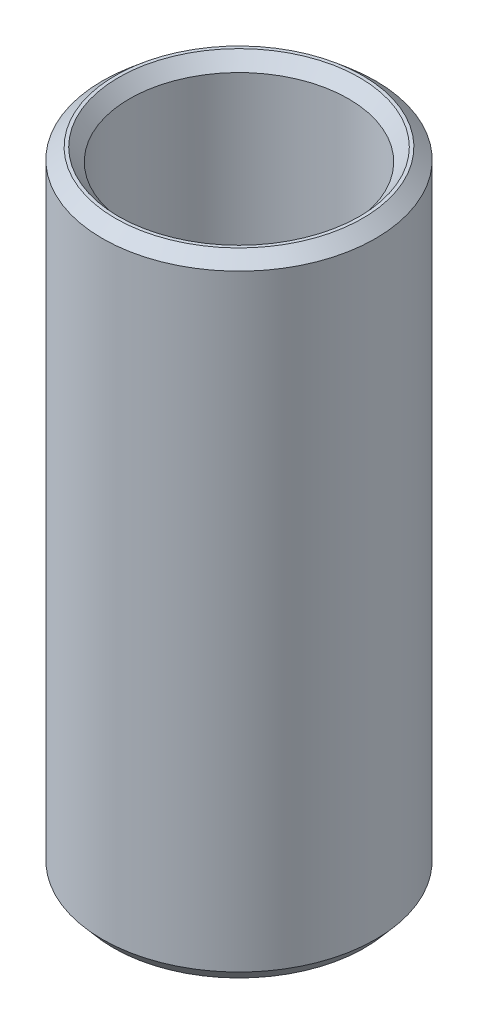
ISO-10303-21;
HEADER;
FILE_DESCRIPTION(('STEP AP214'),'2;1');
FILE_NAME('part.step','',(''),(''),'','','');
FILE_SCHEMA(('AUTOMOTIVE_DESIGN { 1 0 10303 214 1 1 1 1 }'));
ENDSEC;
DATA;
#1=APPLICATION_CONTEXT('core data for automotive mechanical design processes');
#2=APPLICATION_PROTOCOL_DEFINITION('international standard','automotive_design',2000,#1);
#3=PRODUCT_CONTEXT('',#1,'mechanical');
#4=PRODUCT('Part','Part','',(#3));
#5=PRODUCT_RELATED_PRODUCT_CATEGORY('part','',(#4));
#6=PRODUCT_DEFINITION_FORMATION('','',#4);
#7=PRODUCT_DEFINITION_CONTEXT('part definition',#1,'design');
#8=PRODUCT_DEFINITION('design','',#6,#7);
#9=PRODUCT_DEFINITION_SHAPE('','',#8);
#10=(LENGTH_UNIT() NAMED_UNIT(*) SI_UNIT(.MILLI.,.METRE.));
#11=(NAMED_UNIT(*) PLANE_ANGLE_UNIT() SI_UNIT($,.RADIAN.));
#12=(NAMED_UNIT(*) SI_UNIT($,.STERADIAN.) SOLID_ANGLE_UNIT());
#13=UNCERTAINTY_MEASURE_WITH_UNIT(LENGTH_MEASURE(1.E-05),#10,'distance_accuracy_value','');
#14=(GEOMETRIC_REPRESENTATION_CONTEXT(3) GLOBAL_UNCERTAINTY_ASSIGNED_CONTEXT((#13)) GLOBAL_UNIT_ASSIGNED_CONTEXT((#10,
#11,#12)) REPRESENTATION_CONTEXT('',''));
#15=CARTESIAN_POINT('',(0.,0.,0.));
#16=DIRECTION('',(0.,0.,1.));
#17=DIRECTION('',(1.,0.,0.));
#18=AXIS2_PLACEMENT_3D('',#15,#16,#17);
#19=CARTESIAN_POINT('',(0.,138.562156970826,0.));
#20=DIRECTION('',(0.,-1.,0.));
#21=DIRECTION('',(0.,0.,-1.));
#22=AXIS2_PLACEMENT_3D('',#19,#20,#21);
#23=CYLINDRICAL_SURFACE('',#22,30.);
#24=CARTESIAN_POINT('',(0.,2.83569463080405,0.));
#25=DIRECTION('',(0.,1.,0.));
#26=DIRECTION('',(0.,0.,1.));
#27=AXIS2_PLACEMENT_3D('',#24,#25,#26);
#28=CIRCLE('',#27,30.);
#29=CARTESIAN_POINT('',(0.,2.83569463080402,-30.));
#30=VERTEX_POINT('',#29);
#31=EDGE_CURVE('E10',#30,#30,#28,.T.);
#32=CARTESIAN_POINT('',(0.,136.143608110642,0.));
#33=DIRECTION('',(0.,1.,0.));
#34=DIRECTION('',(0.,0.,1.));
#35=AXIS2_PLACEMENT_3D('',#32,#33,#34);
#36=CIRCLE('',#35,30.);
#37=CARTESIAN_POINT('',(0.,136.143608110642,-30.));
#38=VERTEX_POINT('',#37);
#39=EDGE_CURVE('E50',#38,#38,#36,.F.);
#40=CARTESIAN_POINT('',(0.,2.83569463080402,-30.));
#41=CARTESIAN_POINT('',(0.,4.22431872955233,-30.));
#42=CARTESIAN_POINT('',(0.,5.61294282830064,-30.));
#43=CARTESIAN_POINT('',(0.,8.39019102579726,-30.));
#44=CARTESIAN_POINT('',(0.,9.77881512454557,-30.));
#45=CARTESIAN_POINT('',(0.,12.5560633220422,-30.));
#46=CARTESIAN_POINT('',(0.,13.9446874207905,-30.));
#47=CARTESIAN_POINT('',(0.,16.7219356182871,-30.));
#48=CARTESIAN_POINT('',(0.,18.1105597170354,-30.));
#49=CARTESIAN_POINT('',(0.,20.887807914532,-30.));
#50=CARTESIAN_POINT('',(0.,22.2764320132803,-30.));
#51=CARTESIAN_POINT('',(0.,25.053680210777,-30.));
#52=CARTESIAN_POINT('',(0.,26.4423043095253,-30.));
#53=CARTESIAN_POINT('',(0.,29.2195525070219,-30.));
#54=CARTESIAN_POINT('',(0.,30.6081766057702,-30.));
#55=CARTESIAN_POINT('',(0.,33.3854248032668,-30.));
#56=CARTESIAN_POINT('',(0.,34.7740489020151,-30.));
#57=CARTESIAN_POINT('',(0.,37.5512970995117,-30.));
#58=CARTESIAN_POINT('',(0.,38.9399211982601,-30.));
#59=CARTESIAN_POINT('',(0.,41.7171693957567,-30.));
#60=CARTESIAN_POINT('',(0.,43.105793494505,-30.));
#61=CARTESIAN_POINT('',(0.,45.8830416920016,-30.));
#62=CARTESIAN_POINT('',(0.,47.2716657907499,-30.));
#63=CARTESIAN_POINT('',(0.,50.0489139882465,-30.));
#64=CARTESIAN_POINT('',(0.,51.4375380869948,-30.));
#65=CARTESIAN_POINT('',(0.,54.2147862844915,-30.));
#66=CARTESIAN_POINT('',(0.,55.6034103832398,-30.));
#67=CARTESIAN_POINT('',(0.,58.3806585807364,-30.));
#68=CARTESIAN_POINT('',(0.,59.7692826794847,-30.));
#69=CARTESIAN_POINT('',(0.,62.5465308769813,-30.));
#70=CARTESIAN_POINT('',(0.,63.9351549757296,-30.));
#71=CARTESIAN_POINT('',(0.,66.7124031732262,-30.));
#72=CARTESIAN_POINT('',(0.,68.1010272719746,-30.));
#73=CARTESIAN_POINT('',(0.,70.8782754694712,-30.));
#74=CARTESIAN_POINT('',(0.,72.2668995682195,-30.));
#75=CARTESIAN_POINT('',(0.,75.0441477657161,-30.));
#76=CARTESIAN_POINT('',(0.,76.4327718644644,-30.));
#77=CARTESIAN_POINT('',(0.,79.210020061961,-30.));
#78=CARTESIAN_POINT('',(0.,80.5986441607093,-30.));
#79=CARTESIAN_POINT('',(0.,83.375892358206,-30.));
#80=CARTESIAN_POINT('',(0.,84.7645164569543,-30.));
#81=CARTESIAN_POINT('',(0.,87.5417646544509,-30.));
#82=CARTESIAN_POINT('',(0.,88.9303887531992,-30.));
#83=CARTESIAN_POINT('',(0.,91.7076369506958,-30.));
#84=CARTESIAN_POINT('',(0.,93.0962610494441,-30.));
#85=CARTESIAN_POINT('',(0.,95.8735092469407,-30.));
#86=CARTESIAN_POINT('',(0.,97.2621333456891,-30.));
#87=CARTESIAN_POINT('',(0.,100.039381543186,-30.));
#88=CARTESIAN_POINT('',(0.,101.428005641934,-30.));
#89=CARTESIAN_POINT('',(0.,104.205253839431,-30.));
#90=CARTESIAN_POINT('',(0.,105.593877938179,-30.));
#91=CARTESIAN_POINT('',(0.,108.371126135676,-30.));
#92=CARTESIAN_POINT('',(0.,109.759750234424,-30.));
#93=CARTESIAN_POINT('',(0.,112.53699843192,-30.));
#94=CARTESIAN_POINT('',(0.,113.925622530669,-30.));
#95=CARTESIAN_POINT('',(0.,116.702870728165,-30.));
#96=CARTESIAN_POINT('',(0.,118.091494826914,-30.));
#97=CARTESIAN_POINT('',(0.,120.86874302441,-30.));
#98=CARTESIAN_POINT('',(0.,122.257367123159,-30.));
#99=CARTESIAN_POINT('',(0.,125.034615320655,-30.));
#100=CARTESIAN_POINT('',(0.,126.423239419404,-30.));
#101=CARTESIAN_POINT('',(0.,129.2004876169,-30.));
#102=CARTESIAN_POINT('',(0.,130.589111715648,-30.));
#103=CARTESIAN_POINT('',(0.,133.366359913145,-30.));
#104=CARTESIAN_POINT('',(0.,134.754984011893,-30.));
#105=CARTESIAN_POINT('',(0.,136.143608110642,-30.));
#106=B_SPLINE_CURVE_WITH_KNOTS('',3,(#40,#41,#42,#43,#44,#45,#46,#47,#48,#49,#50,#51,#52,#53,
#54,#55,#56,#57,#58,#59,#60,#61,#62,#63,#64,#65,#66,#67,#68,#69,#70,#71,#72,#73,#74,#75,#76,#77,
#78,#79,#80,#81,#82,#83,#84,#85,#86,#87,#88,#89,#90,#91,#92,#93,#94,#95,#96,#97,#98,#99,#100,
#101,#102,#103,#104,#105),.UNSPECIFIED.,.F.,.F.,(4,2,2,2,2,2,2,2,2,2,2,2,2,2,2,2,2,2,2,2,2,2,2,
2,2,2,2,2,2,2,2,2,4),(0.,4.16587229624493,8.33174459248987,12.4976168887348,16.6634891849797,
20.8293614812246,24.9952337774696,29.1611060737145,33.3269783699594,37.4928506662043,
41.6587229624493,45.8245952586942,49.9904675549391,54.1563398511841,58.322212147429,
62.4880844436739,66.6539567399189,70.8198290361638,74.9857013324087,79.1515736286536,
83.3174459248986,87.4833182211435,91.6491905173884,95.8150628136333,99.9809351098783,
104.146807406123,108.312679702368,112.478551998613,116.644424294858,120.810296591103,
124.976168887348,129.142041183593,133.307913479838),.UNSPECIFIED.);
#107=EDGE_CURVE('BSEAM39',#30,#38,#106,.T.);
#108=ORIENTED_EDGE('',*,*,#31,.T.);
#109=ORIENTED_EDGE('',*,*,#39,.T.);
#110=ORIENTED_EDGE('',*,*,#107,.T.);
#111=ORIENTED_EDGE('',*,*,#107,.F.);
#112=EDGE_LOOP('',(#108,#110,#109,#111));
#113=FACE_BOUND('',#112,.T.);
#114=ADVANCED_FACE('F39',(#113),#23,.T.);
#115=CARTESIAN_POINT('',(0.,138.562156970826,0.));
#116=DIRECTION('',(0.,1.,0.));
#117=DIRECTION('',(0.,0.,1.));
#118=AXIS2_PLACEMENT_3D('',#115,#116,#117);
#119=PLANE('',#118);
#120=CARTESIAN_POINT('',(0.,138.562156970826,0.));
#121=DIRECTION('',(0.,1.,0.));
#122=DIRECTION('',(0.,0.,1.));
#123=AXIS2_PLACEMENT_3D('',#120,#121,#122);
#124=CIRCLE('',#123,26.4517690557985);
#125=CARTESIAN_POINT('',(0.,138.562156970826,26.4517690557985));
#126=VERTEX_POINT('',#125);
#127=EDGE_CURVE('E58',#126,#126,#124,.F.);
#128=ORIENTED_EDGE('',*,*,#127,.T.);
#129=EDGE_LOOP('',(#128));
#130=FACE_BOUND('',#129,.T.);
#131=CARTESIAN_POINT('',(0.,138.562156970826,0.));
#132=DIRECTION('',(0.,1.,0.));
#133=DIRECTION('',(0.,0.,1.));
#134=AXIS2_PLACEMENT_3D('',#131,#132,#133);
#135=CIRCLE('',#134,27.1643053691961);
#136=CARTESIAN_POINT('',(0.,138.562156970826,27.1643053691961));
#137=VERTEX_POINT('',#136);
#138=EDGE_CURVE('E61',#137,#137,#135,.T.);
#139=ORIENTED_EDGE('',*,*,#138,.T.);
#140=EDGE_LOOP('',(#139));
#141=FACE_BOUND('',#140,.T.);
#142=ADVANCED_FACE('F88',(#130,#141),#119,.T.);
#143=CARTESIAN_POINT('',(0.,0.,0.));
#144=DIRECTION('',(0.,1.,0.));
#145=DIRECTION('',(0.,0.,1.));
#146=AXIS2_PLACEMENT_3D('',#143,#144,#145);
#147=PLANE('',#146);
#148=CARTESIAN_POINT('',(0.,0.,0.));
#149=DIRECTION('',(0.,1.,0.));
#150=DIRECTION('',(0.,0.,1.));
#151=AXIS2_PLACEMENT_3D('',#148,#149,#150);
#152=CIRCLE('',#151,26.8689148264178);
#153=CARTESIAN_POINT('',(0.,0.,26.8689148264178));
#154=VERTEX_POINT('',#153);
#155=EDGE_CURVE('E51',#154,#154,#152,.T.);
#156=ORIENTED_EDGE('',*,*,#155,.T.);
#157=EDGE_LOOP('',(#156));
#158=FACE_BOUND('',#157,.T.);
#159=CARTESIAN_POINT('',(0.,0.,0.));
#160=DIRECTION('',(0.,1.,0.));
#161=DIRECTION('',(0.,0.,1.));
#162=AXIS2_PLACEMENT_3D('',#159,#160,#161);
#163=CIRCLE('',#162,27.5814511398154);
#164=CARTESIAN_POINT('',(0.,0.,27.5814511398154));
#165=VERTEX_POINT('',#164);
#166=EDGE_CURVE('E54',#165,#165,#163,.F.);
#167=ORIENTED_EDGE('',*,*,#166,.T.);
#168=EDGE_LOOP('',(#167));
#169=FACE_BOUND('',#168,.T.);
#170=ADVANCED_FACE('F83',(#158,#169),#147,.F.);
#171=CARTESIAN_POINT('',(0.,138.562156970826,0.));
#172=DIRECTION('',(0.,-1.,0.));
#173=DIRECTION('',(0.,0.,-1.));
#174=AXIS2_PLACEMENT_3D('',#171,#172,#173);
#175=CYLINDRICAL_SURFACE('',#174,24.0332201956139);
#176=CARTESIAN_POINT('',(0.,135.726462340022,0.));
#177=DIRECTION('',(0.,1.,0.));
#178=DIRECTION('',(0.,0.,1.));
#179=AXIS2_PLACEMENT_3D('',#176,#177,#178);
#180=CIRCLE('',#179,24.0332201956139);
#181=CARTESIAN_POINT('',(0.,135.726462340022,-24.0332201956139));
#182=VERTEX_POINT('',#181);
#183=EDGE_CURVE('E67',#182,#182,#180,.T.);
#184=CARTESIAN_POINT('',(0.,2.41854886018453,0.));
#185=DIRECTION('',(0.,1.,0.));
#186=DIRECTION('',(0.,0.,1.));
#187=AXIS2_PLACEMENT_3D('',#184,#185,#186);
#188=CIRCLE('',#187,24.0332201956139);
#189=CARTESIAN_POINT('',(0.,2.4185488601845,-24.0332201956139));
#190=VERTEX_POINT('',#189);
#191=EDGE_CURVE('E69',#190,#190,#188,.F.);
#192=CARTESIAN_POINT('',(0.,135.726462340022,-24.0332201956139));
#193=CARTESIAN_POINT('',(0.,134.337838241274,-24.0332201956139));
#194=CARTESIAN_POINT('',(0.,132.949214142526,-24.0332201956139));
#195=CARTESIAN_POINT('',(0.,130.171965945029,-24.0332201956139));
#196=CARTESIAN_POINT('',(0.,128.783341846281,-24.0332201956139));
#197=CARTESIAN_POINT('',(0.,126.006093648784,-24.0332201956139));
#198=CARTESIAN_POINT('',(0.,124.617469550036,-24.0332201956139));
#199=CARTESIAN_POINT('',(0.,121.840221352539,-24.0332201956139));
#200=CARTESIAN_POINT('',(0.,120.451597253791,-24.0332201956139));
#201=CARTESIAN_POINT('',(0.,117.674349056294,-24.0332201956139));
#202=CARTESIAN_POINT('',(0.,116.285724957546,-24.0332201956139));
#203=CARTESIAN_POINT('',(0.,113.508476760049,-24.0332201956139));
#204=CARTESIAN_POINT('',(0.,112.119852661301,-24.0332201956139));
#205=CARTESIAN_POINT('',(0.,109.342604463804,-24.0332201956139));
#206=CARTESIAN_POINT('',(0.,107.953980365056,-24.0332201956139));
#207=CARTESIAN_POINT('',(0.,105.176732167559,-24.0332201956139));
#208=CARTESIAN_POINT('',(0.,103.788108068811,-24.0332201956139));
#209=CARTESIAN_POINT('',(0.,101.010859871314,-24.0332201956139));
#210=CARTESIAN_POINT('',(0.,99.6222357725661,-24.0332201956139));
#211=CARTESIAN_POINT('',(0.,96.8449875750695,-24.0332201956139));
#212=CARTESIAN_POINT('',(0.,95.4563634763212,-24.0332201956139));
#213=CARTESIAN_POINT('',(0.,92.6791152788246,-24.0332201956139));
#214=CARTESIAN_POINT('',(0.,91.2904911800763,-24.0332201956139));
#215=CARTESIAN_POINT('',(0.,88.5132429825797,-24.0332201956139));
#216=CARTESIAN_POINT('',(0.,87.1246188838313,-24.0332201956139));
#217=CARTESIAN_POINT('',(0.,84.3473706863347,-24.0332201956139));
#218=CARTESIAN_POINT('',(0.,82.9587465875864,-24.0332201956139));
#219=CARTESIAN_POINT('',(0.,80.1814983900898,-24.0332201956139));
#220=CARTESIAN_POINT('',(0.,78.7928742913415,-24.0332201956139));
#221=CARTESIAN_POINT('',(0.,76.0156260938449,-24.0332201956139));
#222=CARTESIAN_POINT('',(0.,74.6270019950966,-24.0332201956139));
#223=CARTESIAN_POINT('',(0.,71.8497537976,-24.0332201956139));
#224=CARTESIAN_POINT('',(0.,70.4611296988516,-24.0332201956139));
#225=CARTESIAN_POINT('',(0.,67.683881501355,-24.0332201956139));
#226=CARTESIAN_POINT('',(0.,66.2952574026067,-24.0332201956139));
#227=CARTESIAN_POINT('',(0.,63.5180092051101,-24.0332201956139));
#228=CARTESIAN_POINT('',(0.,62.1293851063618,-24.0332201956139));
#229=CARTESIAN_POINT('',(0.,59.3521369088652,-24.0332201956139));
#230=CARTESIAN_POINT('',(0.,57.9635128101169,-24.0332201956139));
#231=CARTESIAN_POINT('',(0.,55.1862646126202,-24.0332201956139));
#232=CARTESIAN_POINT('',(0.,53.7976405138719,-24.0332201956139));
#233=CARTESIAN_POINT('',(0.,51.0203923163753,-24.0332201956139));
#234=CARTESIAN_POINT('',(0.,49.631768217627,-24.0332201956139));
#235=CARTESIAN_POINT('',(0.,46.8545200201304,-24.0332201956139));
#236=CARTESIAN_POINT('',(0.,45.4658959213821,-24.0332201956139));
#237=CARTESIAN_POINT('',(0.,42.6886477238855,-24.0332201956139));
#238=CARTESIAN_POINT('',(0.,41.3000236251372,-24.0332201956139));
#239=CARTESIAN_POINT('',(0.,38.5227754276405,-24.0332201956139));
#240=CARTESIAN_POINT('',(0.,37.1341513288922,-24.0332201956139));
#241=CARTESIAN_POINT('',(0.,34.3569031313956,-24.0332201956139));
#242=CARTESIAN_POINT('',(0.,32.9682790326473,-24.0332201956139));
#243=CARTESIAN_POINT('',(0.,30.1910308351507,-24.0332201956139));
#244=CARTESIAN_POINT('',(0.,28.8024067364023,-24.0332201956139));
#245=CARTESIAN_POINT('',(0.,26.0251585389057,-24.0332201956139));
#246=CARTESIAN_POINT('',(0.,24.6365344401574,-24.0332201956139));
#247=CARTESIAN_POINT('',(0.,21.8592862426608,-24.0332201956139));
#248=CARTESIAN_POINT('',(0.,20.4706621439125,-24.0332201956139));
#249=CARTESIAN_POINT('',(0.,17.6934139464159,-24.0332201956139));
#250=CARTESIAN_POINT('',(0.,16.3047898476676,-24.0332201956139));
#251=CARTESIAN_POINT('',(0.,13.527541650171,-24.0332201956139));
#252=CARTESIAN_POINT('',(0.,12.1389175514227,-24.0332201956139));
#253=CARTESIAN_POINT('',(0.,9.36166935392605,-24.0332201956139));
#254=CARTESIAN_POINT('',(0.,7.97304525517774,-24.0332201956139));
#255=CARTESIAN_POINT('',(0.,5.19579705768112,-24.0332201956139));
#256=CARTESIAN_POINT('',(0.,3.80717295893281,-24.0332201956139));
#257=CARTESIAN_POINT('',(0.,2.4185488601845,-24.0332201956139));
#258=B_SPLINE_CURVE_WITH_KNOTS('',3,(#192,#193,#194,#195,#196,#197,#198,#199,#200,#201,#202,
#203,#204,#205,#206,#207,#208,#209,#210,#211,#212,#213,#214,#215,#216,#217,#218,#219,#220,#221,
#222,#223,#224,#225,#226,#227,#228,#229,#230,#231,#232,#233,#234,#235,#236,#237,#238,#239,#240,
#241,#242,#243,#244,#245,#246,#247,#248,#249,#250,#251,#252,#253,#254,#255,#256,#257),
.UNSPECIFIED.,.F.,.F.,(4,2,2,2,2,2,2,2,2,2,2,2,2,2,2,2,2,2,2,2,2,2,2,2,2,2,2,2,2,2,2,2,4),(0.,
4.16587229624493,8.33174459248987,12.4976168887348,16.6634891849797,20.8293614812247,
24.9952337774696,29.1611060737145,33.3269783699594,37.4928506662044,41.6587229624493,
45.8245952586942,49.9904675549392,54.1563398511841,58.322212147429,62.4880844436739,
66.6539567399189,70.8198290361638,74.9857013324087,79.1515736286537,83.3174459248986,
87.4833182211435,91.6491905173884,95.8150628136334,99.9809351098783,104.146807406123,
108.312679702368,112.478551998613,116.644424294858,120.810296591103,124.976168887348,
129.142041183593,133.307913479838),.UNSPECIFIED.);
#259=EDGE_CURVE('BSEAM71',#182,#190,#258,.T.);
#260=ORIENTED_EDGE('',*,*,#183,.T.);
#261=ORIENTED_EDGE('',*,*,#191,.T.);
#262=ORIENTED_EDGE('',*,*,#259,.T.);
#263=ORIENTED_EDGE('',*,*,#259,.F.);
#264=EDGE_LOOP('',(#260,#262,#261,#263));
#265=FACE_BOUND('',#264,.T.);
#266=ADVANCED_FACE('F71',(#265),#175,.F.);
#267=CARTESIAN_POINT('',(0.,135.726462340022,0.));
#268=DIRECTION('',(0.,1.,0.));
#269=DIRECTION('',(0.,0.,1.));
#270=AXIS2_PLACEMENT_3D('',#267,#268,#269);
#271=CONICAL_SURFACE('',#270,24.0332201956139,0.706172175551748);
#272=ORIENTED_EDGE('',*,*,#127,.F.);
#273=EDGE_LOOP('',(#272));
#274=FACE_BOUND('',#273,.T.);
#275=ORIENTED_EDGE('',*,*,#183,.F.);
#276=EDGE_LOOP('',(#275));
#277=FACE_BOUND('',#276,.T.);
#278=ADVANCED_FACE('F77',(#274,#277),#271,.F.);
#279=CARTESIAN_POINT('',(0.,0.,0.));
#280=DIRECTION('',(0.,-1.,0.));
#281=DIRECTION('',(0.,0.,-1.));
#282=AXIS2_PLACEMENT_3D('',#279,#280,#281);
#283=CONICAL_SURFACE('',#282,26.8689148264178,0.864624151243138);
#284=ORIENTED_EDGE('',*,*,#191,.F.);
#285=EDGE_LOOP('',(#284));
#286=FACE_BOUND('',#285,.T.);
#287=ORIENTED_EDGE('',*,*,#155,.F.);
#288=EDGE_LOOP('',(#287));
#289=FACE_BOUND('',#288,.T.);
#290=ADVANCED_FACE('F73',(#286,#289),#283,.F.);
#291=CARTESIAN_POINT('',(0.,2.83569463080405,0.));
#292=DIRECTION('',(0.,1.,0.));
#293=DIRECTION('',(0.,0.,1.));
#294=AXIS2_PLACEMENT_3D('',#291,#292,#293);
#295=CONICAL_SURFACE('',#294,30.,0.706172175551757);
#296=ORIENTED_EDGE('',*,*,#166,.F.);
#297=EDGE_LOOP('',(#296));
#298=FACE_BOUND('',#297,.T.);
#299=ORIENTED_EDGE('',*,*,#31,.F.);
#300=EDGE_LOOP('',(#299));
#301=FACE_BOUND('',#300,.T.);
#302=ADVANCED_FACE('F76',(#298,#301),#295,.T.);
#303=CARTESIAN_POINT('',(0.,138.562156970826,0.));
#304=DIRECTION('',(0.,-1.,0.));
#305=DIRECTION('',(0.,0.,-1.));
#306=AXIS2_PLACEMENT_3D('',#303,#304,#305);
#307=CONICAL_SURFACE('',#306,27.1643053691961,0.864624151243142);
#308=ORIENTED_EDGE('',*,*,#39,.F.);
#309=EDGE_LOOP('',(#308));
#310=FACE_BOUND('',#309,.T.);
#311=ORIENTED_EDGE('',*,*,#138,.F.);
#312=EDGE_LOOP('',(#311));
#313=FACE_BOUND('',#312,.T.);
#314=ADVANCED_FACE('F45',(#310,#313),#307,.T.);
#315=CLOSED_SHELL('',(#114,#142,#170,#266,#278,#290,#302,#314));
#316=MANIFOLD_SOLID_BREP('B2',#315);
#317=ADVANCED_BREP_SHAPE_REPRESENTATION('',(#18,#316),#14);
#318=SHAPE_DEFINITION_REPRESENTATION(#9,#317);
ENDSEC;
END-ISO-10303-21;
